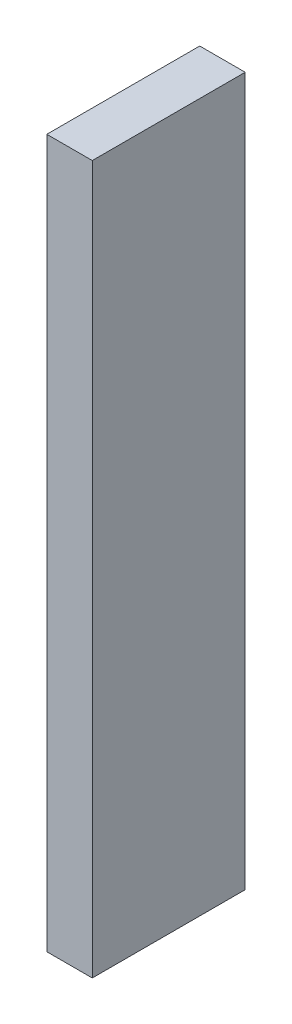
ISO-10303-21;
HEADER;
FILE_DESCRIPTION(('STEP AP214'),'2;1');
FILE_NAME('part.step','',(''),(''),'','','');
FILE_SCHEMA(('AUTOMOTIVE_DESIGN { 1 0 10303 214 1 1 1 1 }'));
ENDSEC;
DATA;
#1=APPLICATION_CONTEXT('core data for automotive mechanical design processes');
#2=APPLICATION_PROTOCOL_DEFINITION('international standard','automotive_design',2000,#1);
#3=PRODUCT_CONTEXT('',#1,'mechanical');
#4=PRODUCT('Part','Part','',(#3));
#5=PRODUCT_RELATED_PRODUCT_CATEGORY('part','',(#4));
#6=PRODUCT_DEFINITION_FORMATION('','',#4);
#7=PRODUCT_DEFINITION_CONTEXT('part definition',#1,'design');
#8=PRODUCT_DEFINITION('design','',#6,#7);
#9=PRODUCT_DEFINITION_SHAPE('','',#8);
#10=(LENGTH_UNIT() NAMED_UNIT(*) SI_UNIT(.MILLI.,.METRE.));
#11=(NAMED_UNIT(*) PLANE_ANGLE_UNIT() SI_UNIT($,.RADIAN.));
#12=(NAMED_UNIT(*) SI_UNIT($,.STERADIAN.) SOLID_ANGLE_UNIT());
#13=UNCERTAINTY_MEASURE_WITH_UNIT(LENGTH_MEASURE(1.E-05),#10,'distance_accuracy_value','');
#14=(GEOMETRIC_REPRESENTATION_CONTEXT(3) GLOBAL_UNCERTAINTY_ASSIGNED_CONTEXT((#13)) GLOBAL_UNIT_ASSIGNED_CONTEXT((#10,
#11,#12)) REPRESENTATION_CONTEXT('',''));
#15=CARTESIAN_POINT('',(0.,0.,0.));
#16=DIRECTION('',(0.,0.,1.));
#17=DIRECTION('',(1.,0.,0.));
#18=AXIS2_PLACEMENT_3D('',#15,#16,#17);
#19=CARTESIAN_POINT('',(130.275545229403,22.4180708263693,76.0720282028969));
#20=DIRECTION('',(-1.69244514382854E-09,0.,1.));
#21=DIRECTION('',(1.,0.,1.69244514382854E-09));
#22=AXIS2_PLACEMENT_3D('',#19,#20,#21);
#23=PLANE('',#22);
#24=DIRECTION('',(0.,-1.,0.));
#25=VECTOR('',#24,1.);
#26=CARTESIAN_POINT('',(131.258630326416,22.4180708263693,76.0720282045608));
#27=LINE('',#26,#25);
#28=CARTESIAN_POINT('',(131.258630326416,22.4180708263693,76.0720282045608));
#29=VERTEX_POINT('',#28);
#30=CARTESIAN_POINT('',(131.258630326416,7.11212965552236,76.0720282045608));
#31=VERTEX_POINT('',#30);
#32=EDGE_CURVE('E79',#29,#31,#27,.T.);
#33=ORIENTED_EDGE('',*,*,#32,.F.);
#34=DIRECTION('',(1.,0.,1.69244514382854E-09));
#35=VECTOR('',#34,1.);
#36=CARTESIAN_POINT('',(130.275545229403,22.4180708263693,76.0720282028969));
#37=LINE('',#36,#35);
#38=CARTESIAN_POINT('',(130.275545229403,22.4180708263693,76.0720282028969));
#39=VERTEX_POINT('',#38);
#40=EDGE_CURVE('E32',#39,#29,#37,.T.);
#41=ORIENTED_EDGE('',*,*,#40,.F.);
#42=DIRECTION('',(0.,-1.,0.));
#43=VECTOR('',#42,1.);
#44=CARTESIAN_POINT('',(130.275545229403,22.4180708263693,76.0720282028969));
#45=LINE('',#44,#43);
#46=CARTESIAN_POINT('',(130.275545229403,7.11212965552236,76.0720282028969));
#47=VERTEX_POINT('',#46);
#48=EDGE_CURVE('E71',#39,#47,#45,.T.);
#49=ORIENTED_EDGE('',*,*,#48,.T.);
#50=DIRECTION('',(1.,0.,1.69244514382854E-09));
#51=VECTOR('',#50,1.);
#52=CARTESIAN_POINT('',(130.275545229403,7.11212965552236,76.0720282028969));
#53=LINE('',#52,#51);
#54=EDGE_CURVE('E10',#47,#31,#53,.T.);
#55=ORIENTED_EDGE('',*,*,#54,.T.);
#56=EDGE_LOOP('',(#33,#41,#49,#55));
#57=FACE_BOUND('',#56,.T.);
#58=ADVANCED_FACE('F16',(#57),#23,.T.);
#59=CARTESIAN_POINT('',(130.275545229403,7.11212965552236,76.0720282028969));
#60=DIRECTION('',(0.,-1.,0.));
#61=DIRECTION('',(0.,0.,-1.));
#62=AXIS2_PLACEMENT_3D('',#59,#60,#61);
#63=PLANE('',#62);
#64=DIRECTION('',(1.69244514382854E-09,0.,-1.));
#65=VECTOR('',#64,1.);
#66=CARTESIAN_POINT('',(131.258630326416,7.11212965552236,76.0720282045608));
#67=LINE('',#66,#65);
#68=CARTESIAN_POINT('',(131.258630332012,7.11212965552235,72.766087033712));
#69=VERTEX_POINT('',#68);
#70=EDGE_CURVE('E82',#31,#69,#67,.T.);
#71=ORIENTED_EDGE('',*,*,#70,.F.);
#72=ORIENTED_EDGE('',*,*,#54,.F.);
#73=DIRECTION('',(1.69244514382854E-09,0.,-1.));
#74=VECTOR('',#73,1.);
#75=CARTESIAN_POINT('',(130.275545229403,7.11212965552236,76.0720282028969));
#76=LINE('',#75,#74);
#77=CARTESIAN_POINT('',(130.275545234999,7.11212965552235,72.7660870320482));
#78=VERTEX_POINT('',#77);
#79=EDGE_CURVE('E67',#47,#78,#76,.T.);
#80=ORIENTED_EDGE('',*,*,#79,.T.);
#81=DIRECTION('',(1.,0.,1.69244514382854E-09));
#82=VECTOR('',#81,1.);
#83=CARTESIAN_POINT('',(130.275545234999,7.11212965552235,72.7660870320482));
#84=LINE('',#83,#82);
#85=EDGE_CURVE('E24',#78,#69,#84,.T.);
#86=ORIENTED_EDGE('',*,*,#85,.T.);
#87=EDGE_LOOP('',(#71,#72,#80,#86));
#88=FACE_BOUND('',#87,.T.);
#89=ADVANCED_FACE('F68',(#88),#63,.T.);
#90=CARTESIAN_POINT('',(130.275545234999,7.11212965552235,72.7660870320482));
#91=DIRECTION('',(1.69244514382854E-09,0.,-1.));
#92=DIRECTION('',(-1.,0.,-1.69244514382854E-09));
#93=AXIS2_PLACEMENT_3D('',#90,#91,#92);
#94=PLANE('',#93);
#95=DIRECTION('',(0.,1.,0.));
#96=VECTOR('',#95,1.);
#97=CARTESIAN_POINT('',(131.258630332012,7.11212965552235,72.766087033712));
#98=LINE('',#97,#96);
#99=CARTESIAN_POINT('',(131.258630332012,22.418070826371,72.7660870252515));
#100=VERTEX_POINT('',#99);
#101=EDGE_CURVE('E65',#69,#100,#98,.T.);
#102=ORIENTED_EDGE('',*,*,#101,.F.);
#103=ORIENTED_EDGE('',*,*,#85,.F.);
#104=DIRECTION('',(0.,1.,0.));
#105=VECTOR('',#104,1.);
#106=CARTESIAN_POINT('',(130.275545234999,7.11212965552235,72.7660870320482));
#107=LINE('',#106,#105);
#108=CARTESIAN_POINT('',(130.275545234999,22.418070826371,72.7660870235877));
#109=VERTEX_POINT('',#108);
#110=EDGE_CURVE('E62',#78,#109,#107,.T.);
#111=ORIENTED_EDGE('',*,*,#110,.T.);
#112=DIRECTION('',(1.,0.,1.69244514382854E-09));
#113=VECTOR('',#112,1.);
#114=CARTESIAN_POINT('',(130.275545234999,22.418070826371,72.7660870235877));
#115=LINE('',#114,#113);
#116=EDGE_CURVE('E48',#109,#100,#115,.T.);
#117=ORIENTED_EDGE('',*,*,#116,.T.);
#118=EDGE_LOOP('',(#102,#103,#111,#117));
#119=FACE_BOUND('',#118,.T.);
#120=ADVANCED_FACE('F60',(#119),#94,.T.);
#121=CARTESIAN_POINT('',(130.275545234999,22.418070826371,72.7660870235877));
#122=DIRECTION('',(0.,1.,0.));
#123=DIRECTION('',(-1.,0.,0.));
#124=AXIS2_PLACEMENT_3D('',#121,#122,#123);
#125=PLANE('',#124);
#126=DIRECTION('',(-1.69244514382854E-09,0.,1.));
#127=VECTOR('',#126,1.);
#128=CARTESIAN_POINT('',(131.258630332012,22.418070826371,72.7660870252515));
#129=LINE('',#128,#127);
#130=EDGE_CURVE('E85',#100,#29,#129,.T.);
#131=ORIENTED_EDGE('',*,*,#130,.F.);
#132=ORIENTED_EDGE('',*,*,#116,.F.);
#133=DIRECTION('',(-1.69244514382854E-09,0.,1.));
#134=VECTOR('',#133,1.);
#135=CARTESIAN_POINT('',(130.275545234999,22.418070826371,72.7660870235877));
#136=LINE('',#135,#134);
#137=EDGE_CURVE('E74',#109,#39,#136,.T.);
#138=ORIENTED_EDGE('',*,*,#137,.T.);
#139=ORIENTED_EDGE('',*,*,#40,.T.);
#140=EDGE_LOOP('',(#131,#132,#138,#139));
#141=FACE_BOUND('',#140,.T.);
#142=ADVANCED_FACE('F96',(#141),#125,.T.);
#143=CARTESIAN_POINT('',(130.275545201028,17.2651002409467,92.8378644340291));
#144=DIRECTION('',(1.,0.,1.69244514382854E-09));
#145=DIRECTION('',(0.,1.,0.));
#146=AXIS2_PLACEMENT_3D('',#143,#144,#145);
#147=PLANE('',#146);
#148=ORIENTED_EDGE('',*,*,#48,.F.);
#149=ORIENTED_EDGE('',*,*,#137,.F.);
#150=ORIENTED_EDGE('',*,*,#110,.F.);
#151=ORIENTED_EDGE('',*,*,#79,.F.);
#152=EDGE_LOOP('',(#148,#149,#150,#151));
#153=FACE_BOUND('',#152,.T.);
#154=ADVANCED_FACE('F73',(#153),#147,.F.);
#155=CARTESIAN_POINT('',(131.258630298041,17.2651002409467,92.8378644356929));
#156=DIRECTION('',(1.,0.,1.69244514382854E-09));
#157=DIRECTION('',(0.,1.,0.));
#158=AXIS2_PLACEMENT_3D('',#155,#156,#157);
#159=PLANE('',#158);
#160=ORIENTED_EDGE('',*,*,#32,.T.);
#161=ORIENTED_EDGE('',*,*,#70,.T.);
#162=ORIENTED_EDGE('',*,*,#101,.T.);
#163=ORIENTED_EDGE('',*,*,#130,.T.);
#164=EDGE_LOOP('',(#160,#161,#162,#163));
#165=FACE_BOUND('',#164,.T.);
#166=ADVANCED_FACE('F89',(#165),#159,.T.);
#167=CLOSED_SHELL('',(#58,#89,#120,#142,#154,#166));
#168=MANIFOLD_SOLID_BREP('B1',#167);
#169=ADVANCED_BREP_SHAPE_REPRESENTATION('',(#18,#168),#14);
#170=SHAPE_DEFINITION_REPRESENTATION(#9,#169);
ENDSEC;
END-ISO-10303-21;
